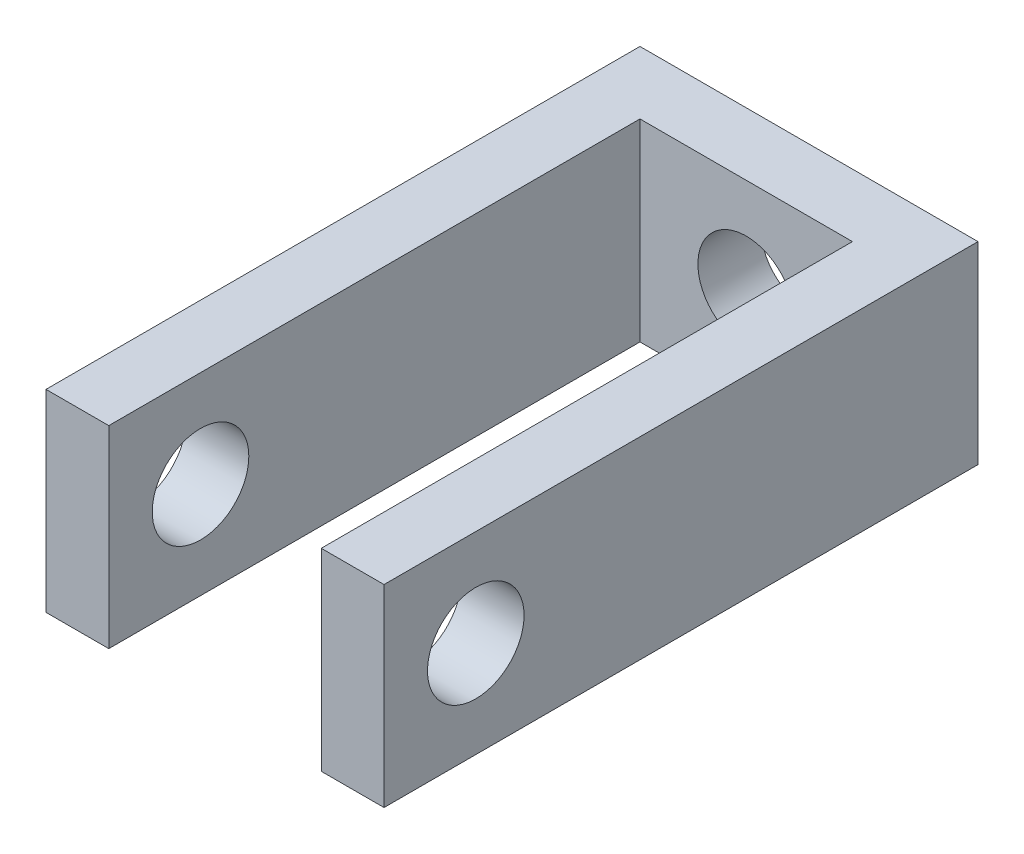
ISO-10303-21;
HEADER;
FILE_DESCRIPTION(('STEP AP214'),'2;1');
FILE_NAME('part.step','',(''),(''),'','','');
FILE_SCHEMA(('AUTOMOTIVE_DESIGN { 1 0 10303 214 1 1 1 1 }'));
ENDSEC;
DATA;
#1=APPLICATION_CONTEXT('core data for automotive mechanical design processes');
#2=APPLICATION_PROTOCOL_DEFINITION('international standard','automotive_design',2000,#1);
#3=PRODUCT_CONTEXT('',#1,'mechanical');
#4=PRODUCT('Part','Part','',(#3));
#5=PRODUCT_RELATED_PRODUCT_CATEGORY('part','',(#4));
#6=PRODUCT_DEFINITION_FORMATION('','',#4);
#7=PRODUCT_DEFINITION_CONTEXT('part definition',#1,'design');
#8=PRODUCT_DEFINITION('design','',#6,#7);
#9=PRODUCT_DEFINITION_SHAPE('','',#8);
#10=(LENGTH_UNIT() NAMED_UNIT(*) SI_UNIT(.MILLI.,.METRE.));
#11=(NAMED_UNIT(*) PLANE_ANGLE_UNIT() SI_UNIT($,.RADIAN.));
#12=(NAMED_UNIT(*) SI_UNIT($,.STERADIAN.) SOLID_ANGLE_UNIT());
#13=UNCERTAINTY_MEASURE_WITH_UNIT(LENGTH_MEASURE(1.E-05),#10,'distance_accuracy_value','');
#14=(GEOMETRIC_REPRESENTATION_CONTEXT(3) GLOBAL_UNCERTAINTY_ASSIGNED_CONTEXT((#13)) GLOBAL_UNIT_ASSIGNED_CONTEXT((#10,
#11,#12)) REPRESENTATION_CONTEXT('',''));
#15=CARTESIAN_POINT('',(0.,0.,0.));
#16=DIRECTION('',(0.,0.,1.));
#17=DIRECTION('',(1.,0.,0.));
#18=AXIS2_PLACEMENT_3D('',#15,#16,#17);
#19=CARTESIAN_POINT('',(0.,0.,1.3));
#20=DIRECTION('',(0.,0.,-1.));
#21=DIRECTION('',(-1.,0.,0.));
#22=AXIS2_PLACEMENT_3D('',#19,#20,#21);
#23=PLANE('',#22);
#24=CARTESIAN_POINT('',(3.5,2.,1.3));
#25=DIRECTION('',(0.,0.,1.));
#26=DIRECTION('',(1.,0.,0.));
#27=AXIS2_PLACEMENT_3D('',#24,#25,#26);
#28=CIRCLE('',#27,0.999999999999999);
#29=CARTESIAN_POINT('',(4.5,2.,1.3));
#30=VERTEX_POINT('',#29);
#31=EDGE_CURVE('E140',#30,#30,#28,.T.);
#32=ORIENTED_EDGE('',*,*,#31,.F.);
#33=EDGE_LOOP('',(#32));
#34=FACE_BOUND('',#33,.T.);
#35=DIRECTION('',(0.,-1.,0.));
#36=VECTOR('',#35,1.);
#37=CARTESIAN_POINT('',(5.7,4.,1.3));
#38=LINE('',#37,#36);
#39=CARTESIAN_POINT('',(5.7,4.,1.3));
#40=VERTEX_POINT('',#39);
#41=CARTESIAN_POINT('',(5.7,0.,1.3));
#42=VERTEX_POINT('',#41);
#43=EDGE_CURVE('E134',#40,#42,#38,.T.);
#44=ORIENTED_EDGE('',*,*,#43,.F.);
#45=DIRECTION('',(-1.,0.,0.));
#46=VECTOR('',#45,1.);
#47=CARTESIAN_POINT('',(0.,4.,1.3));
#48=LINE('',#47,#46);
#49=CARTESIAN_POINT('',(1.3,4.,1.3));
#50=VERTEX_POINT('',#49);
#51=EDGE_CURVE('E180',#40,#50,#48,.T.);
#52=ORIENTED_EDGE('',*,*,#51,.T.);
#53=DIRECTION('',(0.,1.,0.));
#54=VECTOR('',#53,1.);
#55=CARTESIAN_POINT('',(1.3,4.,1.3));
#56=LINE('',#55,#54);
#57=CARTESIAN_POINT('',(1.3,0.,1.3));
#58=VERTEX_POINT('',#57);
#59=EDGE_CURVE('E62',#58,#50,#56,.T.);
#60=ORIENTED_EDGE('',*,*,#59,.F.);
#61=DIRECTION('',(1.,0.,0.));
#62=VECTOR('',#61,1.);
#63=CARTESIAN_POINT('',(0.,0.,1.3));
#64=LINE('',#63,#62);
#65=EDGE_CURVE('E57',#58,#42,#64,.T.);
#66=ORIENTED_EDGE('',*,*,#65,.T.);
#67=EDGE_LOOP('',(#44,#52,#60,#66));
#68=FACE_BOUND('',#67,.T.);
#69=ADVANCED_FACE('F39',(#34,#68),#23,.F.);
#70=CARTESIAN_POINT('',(0.,0.,1.3));
#71=DIRECTION('',(1.,0.,0.));
#72=DIRECTION('',(0.,0.,-1.));
#73=AXIS2_PLACEMENT_3D('',#70,#71,#72);
#74=PLANE('',#73);
#75=CARTESIAN_POINT('',(0.,2.,10.4));
#76=DIRECTION('',(1.,0.,0.));
#77=DIRECTION('',(0.,0.,-1.));
#78=AXIS2_PLACEMENT_3D('',#75,#76,#77);
#79=CIRCLE('',#78,1.);
#80=CARTESIAN_POINT('',(0.,2.,9.4));
#81=VERTEX_POINT('',#80);
#82=EDGE_CURVE('E213',#81,#81,#79,.T.);
#83=ORIENTED_EDGE('',*,*,#82,.T.);
#84=EDGE_LOOP('',(#83));
#85=FACE_BOUND('',#84,.T.);
#86=DIRECTION('',(0.,-1.,0.));
#87=VECTOR('',#86,1.);
#88=CARTESIAN_POINT('',(0.,0.,0.));
#89=LINE('',#88,#87);
#90=CARTESIAN_POINT('',(0.,4.,0.));
#91=VERTEX_POINT('',#90);
#92=CARTESIAN_POINT('',(0.,0.,0.));
#93=VERTEX_POINT('',#92);
#94=EDGE_CURVE('E177',#91,#93,#89,.T.);
#95=ORIENTED_EDGE('',*,*,#94,.T.);
#96=DIRECTION('',(0.,0.,-1.));
#97=VECTOR('',#96,1.);
#98=CARTESIAN_POINT('',(0.,0.,1.3));
#99=LINE('',#98,#97);
#100=CARTESIAN_POINT('',(0.,0.,12.3));
#101=VERTEX_POINT('',#100);
#102=EDGE_CURVE('E11',#101,#93,#99,.T.);
#103=ORIENTED_EDGE('',*,*,#102,.F.);
#104=DIRECTION('',(0.,-1.,0.));
#105=VECTOR('',#104,1.);
#106=CARTESIAN_POINT('',(0.,4.,12.3));
#107=LINE('',#106,#105);
#108=CARTESIAN_POINT('',(0.,4.,12.3));
#109=VERTEX_POINT('',#108);
#110=EDGE_CURVE('E153',#109,#101,#107,.T.);
#111=ORIENTED_EDGE('',*,*,#110,.F.);
#112=DIRECTION('',(0.,0.,-1.));
#113=VECTOR('',#112,1.);
#114=CARTESIAN_POINT('',(0.,4.,1.3));
#115=LINE('',#114,#113);
#116=EDGE_CURVE('E117',#109,#91,#115,.T.);
#117=ORIENTED_EDGE('',*,*,#116,.T.);
#118=EDGE_LOOP('',(#95,#103,#111,#117));
#119=FACE_BOUND('',#118,.T.);
#120=ADVANCED_FACE('F41',(#85,#119),#74,.F.);
#121=CARTESIAN_POINT('',(0.,0.,1.3));
#122=DIRECTION('',(0.,1.,0.));
#123=DIRECTION('',(0.,0.,1.));
#124=AXIS2_PLACEMENT_3D('',#121,#122,#123);
#125=PLANE('',#124);
#126=DIRECTION('',(1.,0.,0.));
#127=VECTOR('',#126,1.);
#128=CARTESIAN_POINT('',(0.,0.,0.));
#129=LINE('',#128,#127);
#130=CARTESIAN_POINT('',(7.,0.,0.));
#131=VERTEX_POINT('',#130);
#132=EDGE_CURVE('E187',#93,#131,#129,.T.);
#133=ORIENTED_EDGE('',*,*,#132,.T.);
#134=DIRECTION('',(0.,0.,-1.));
#135=VECTOR('',#134,1.);
#136=CARTESIAN_POINT('',(7.,0.,1.3));
#137=LINE('',#136,#135);
#138=CARTESIAN_POINT('',(7.,0.,12.3));
#139=VERTEX_POINT('',#138);
#140=EDGE_CURVE('E49',#139,#131,#137,.T.);
#141=ORIENTED_EDGE('',*,*,#140,.F.);
#142=DIRECTION('',(1.,0.,0.));
#143=VECTOR('',#142,1.);
#144=CARTESIAN_POINT('',(7.,0.,12.3));
#145=LINE('',#144,#143);
#146=CARTESIAN_POINT('',(5.7,0.,12.3));
#147=VERTEX_POINT('',#146);
#148=EDGE_CURVE('E132',#147,#139,#145,.T.);
#149=ORIENTED_EDGE('',*,*,#148,.F.);
#150=DIRECTION('',(0.,0.,-1.));
#151=VECTOR('',#150,1.);
#152=CARTESIAN_POINT('',(5.7,0.,12.3));
#153=LINE('',#152,#151);
#154=EDGE_CURVE('E146',#147,#42,#153,.T.);
#155=ORIENTED_EDGE('',*,*,#154,.T.);
#156=ORIENTED_EDGE('',*,*,#65,.F.);
#157=DIRECTION('',(0.,0.,-1.));
#158=VECTOR('',#157,1.);
#159=CARTESIAN_POINT('',(1.3,0.,12.3));
#160=LINE('',#159,#158);
#161=CARTESIAN_POINT('',(1.3,0.,12.3));
#162=VERTEX_POINT('',#161);
#163=EDGE_CURVE('E173',#162,#58,#160,.T.);
#164=ORIENTED_EDGE('',*,*,#163,.F.);
#165=DIRECTION('',(1.,0.,0.));
#166=VECTOR('',#165,1.);
#167=CARTESIAN_POINT('',(0.,0.,12.3));
#168=LINE('',#167,#166);
#169=EDGE_CURVE('E157',#101,#162,#168,.T.);
#170=ORIENTED_EDGE('',*,*,#169,.F.);
#171=ORIENTED_EDGE('',*,*,#102,.T.);
#172=EDGE_LOOP('',(#133,#141,#149,#155,#156,#164,#170,#171));
#173=FACE_BOUND('',#172,.T.);
#174=ADVANCED_FACE('F242',(#173),#125,.F.);
#175=CARTESIAN_POINT('',(7.,0.,1.3));
#176=DIRECTION('',(-1.,0.,0.));
#177=DIRECTION('',(0.,0.,1.));
#178=AXIS2_PLACEMENT_3D('',#175,#176,#177);
#179=PLANE('',#178);
#180=CARTESIAN_POINT('',(7.,2.,10.4));
#181=DIRECTION('',(1.,0.,0.));
#182=DIRECTION('',(0.,0.,-1.));
#183=AXIS2_PLACEMENT_3D('',#180,#181,#182);
#184=CIRCLE('',#183,1.);
#185=CARTESIAN_POINT('',(7.,2.,9.4));
#186=VERTEX_POINT('',#185);
#187=EDGE_CURVE('E215',#186,#186,#184,.T.);
#188=ORIENTED_EDGE('',*,*,#187,.F.);
#189=EDGE_LOOP('',(#188));
#190=FACE_BOUND('',#189,.T.);
#191=DIRECTION('',(0.,1.,0.));
#192=VECTOR('',#191,1.);
#193=CARTESIAN_POINT('',(7.,0.,0.));
#194=LINE('',#193,#192);
#195=CARTESIAN_POINT('',(7.,4.,0.));
#196=VERTEX_POINT('',#195);
#197=EDGE_CURVE('E113',#131,#196,#194,.T.);
#198=ORIENTED_EDGE('',*,*,#197,.T.);
#199=DIRECTION('',(0.,0.,-1.));
#200=VECTOR('',#199,1.);
#201=CARTESIAN_POINT('',(7.,4.,1.3));
#202=LINE('',#201,#200);
#203=CARTESIAN_POINT('',(7.,4.,12.3));
#204=VERTEX_POINT('',#203);
#205=EDGE_CURVE('E106',#204,#196,#202,.T.);
#206=ORIENTED_EDGE('',*,*,#205,.F.);
#207=DIRECTION('',(0.,1.,0.));
#208=VECTOR('',#207,1.);
#209=CARTESIAN_POINT('',(7.,4.,12.3));
#210=LINE('',#209,#208);
#211=EDGE_CURVE('E111',#139,#204,#210,.T.);
#212=ORIENTED_EDGE('',*,*,#211,.F.);
#213=ORIENTED_EDGE('',*,*,#140,.T.);
#214=EDGE_LOOP('',(#198,#206,#212,#213));
#215=FACE_BOUND('',#214,.T.);
#216=ADVANCED_FACE('F108',(#190,#215),#179,.F.);
#217=CARTESIAN_POINT('',(0.,4.,1.3));
#218=DIRECTION('',(0.,-1.,0.));
#219=DIRECTION('',(0.,0.,-1.));
#220=AXIS2_PLACEMENT_3D('',#217,#218,#219);
#221=PLANE('',#220);
#222=DIRECTION('',(-1.,0.,0.));
#223=VECTOR('',#222,1.);
#224=CARTESIAN_POINT('',(0.,4.,0.));
#225=LINE('',#224,#223);
#226=EDGE_CURVE('E181',#196,#91,#225,.T.);
#227=ORIENTED_EDGE('',*,*,#226,.T.);
#228=ORIENTED_EDGE('',*,*,#116,.F.);
#229=DIRECTION('',(-1.,0.,0.));
#230=VECTOR('',#229,1.);
#231=CARTESIAN_POINT('',(0.,4.,12.3));
#232=LINE('',#231,#230);
#233=CARTESIAN_POINT('',(1.3,4.,12.3));
#234=VERTEX_POINT('',#233);
#235=EDGE_CURVE('E163',#234,#109,#232,.T.);
#236=ORIENTED_EDGE('',*,*,#235,.F.);
#237=DIRECTION('',(0.,0.,-1.));
#238=VECTOR('',#237,1.);
#239=CARTESIAN_POINT('',(1.3,4.,12.3));
#240=LINE('',#239,#238);
#241=EDGE_CURVE('E167',#234,#50,#240,.T.);
#242=ORIENTED_EDGE('',*,*,#241,.T.);
#243=ORIENTED_EDGE('',*,*,#51,.F.);
#244=DIRECTION('',(0.,0.,-1.));
#245=VECTOR('',#244,1.);
#246=CARTESIAN_POINT('',(5.7,4.,12.3));
#247=LINE('',#246,#245);
#248=CARTESIAN_POINT('',(5.7,4.,12.3));
#249=VERTEX_POINT('',#248);
#250=EDGE_CURVE('E123',#249,#40,#247,.T.);
#251=ORIENTED_EDGE('',*,*,#250,.F.);
#252=DIRECTION('',(-1.,0.,0.));
#253=VECTOR('',#252,1.);
#254=CARTESIAN_POINT('',(7.,4.,12.3));
#255=LINE('',#254,#253);
#256=EDGE_CURVE('E120',#204,#249,#255,.T.);
#257=ORIENTED_EDGE('',*,*,#256,.F.);
#258=ORIENTED_EDGE('',*,*,#205,.T.);
#259=EDGE_LOOP('',(#227,#228,#236,#242,#243,#251,#257,#258));
#260=FACE_BOUND('',#259,.T.);
#261=ADVANCED_FACE('F121',(#260),#221,.F.);
#262=CARTESIAN_POINT('',(0.,0.,0.));
#263=DIRECTION('',(0.,0.,-1.));
#264=DIRECTION('',(-1.,0.,0.));
#265=AXIS2_PLACEMENT_3D('',#262,#263,#264);
#266=PLANE('',#265);
#267=CARTESIAN_POINT('',(3.5,2.,0.));
#268=DIRECTION('',(0.,0.,-1.));
#269=DIRECTION('',(-1.,0.,0.));
#270=AXIS2_PLACEMENT_3D('',#267,#268,#269);
#271=CIRCLE('',#270,0.999999999999999);
#272=CARTESIAN_POINT('',(2.5,2.,0.));
#273=VERTEX_POINT('',#272);
#274=EDGE_CURVE('E137',#273,#273,#271,.T.);
#275=ORIENTED_EDGE('',*,*,#274,.F.);
#276=EDGE_LOOP('',(#275));
#277=FACE_BOUND('',#276,.T.);
#278=ORIENTED_EDGE('',*,*,#94,.F.);
#279=ORIENTED_EDGE('',*,*,#226,.F.);
#280=ORIENTED_EDGE('',*,*,#197,.F.);
#281=ORIENTED_EDGE('',*,*,#132,.F.);
#282=EDGE_LOOP('',(#278,#279,#280,#281));
#283=FACE_BOUND('',#282,.T.);
#284=ADVANCED_FACE('F247',(#277,#283),#266,.T.);
#285=CARTESIAN_POINT('',(1.3,4.,12.3));
#286=DIRECTION('',(-1.,0.,0.));
#287=DIRECTION('',(0.,-1.,0.));
#288=AXIS2_PLACEMENT_3D('',#285,#286,#287);
#289=PLANE('',#288);
#290=CARTESIAN_POINT('',(1.3,2.,10.4));
#291=DIRECTION('',(-1.,0.,0.));
#292=DIRECTION('',(0.,-1.,0.));
#293=AXIS2_PLACEMENT_3D('',#290,#291,#292);
#294=CIRCLE('',#293,1.);
#295=CARTESIAN_POINT('',(1.3,1.,10.4));
#296=VERTEX_POINT('',#295);
#297=EDGE_CURVE('E204',#296,#296,#294,.T.);
#298=ORIENTED_EDGE('',*,*,#297,.T.);
#299=EDGE_LOOP('',(#298));
#300=FACE_BOUND('',#299,.T.);
#301=ORIENTED_EDGE('',*,*,#59,.T.);
#302=ORIENTED_EDGE('',*,*,#241,.F.);
#303=DIRECTION('',(0.,1.,0.));
#304=VECTOR('',#303,1.);
#305=CARTESIAN_POINT('',(1.3,4.,12.3));
#306=LINE('',#305,#304);
#307=EDGE_CURVE('E160',#162,#234,#306,.T.);
#308=ORIENTED_EDGE('',*,*,#307,.F.);
#309=ORIENTED_EDGE('',*,*,#163,.T.);
#310=EDGE_LOOP('',(#301,#302,#308,#309));
#311=FACE_BOUND('',#310,.T.);
#312=ADVANCED_FACE('F245',(#300,#311),#289,.F.);
#313=CARTESIAN_POINT('',(0.,0.,12.3));
#314=DIRECTION('',(0.,0.,1.));
#315=DIRECTION('',(1.,0.,0.));
#316=AXIS2_PLACEMENT_3D('',#313,#314,#315);
#317=PLANE('',#316);
#318=ORIENTED_EDGE('',*,*,#110,.T.);
#319=ORIENTED_EDGE('',*,*,#169,.T.);
#320=ORIENTED_EDGE('',*,*,#307,.T.);
#321=ORIENTED_EDGE('',*,*,#235,.T.);
#322=EDGE_LOOP('',(#318,#319,#320,#321));
#323=FACE_BOUND('',#322,.T.);
#324=ADVANCED_FACE('F265',(#323),#317,.T.);
#325=CARTESIAN_POINT('',(5.7,4.,12.3));
#326=DIRECTION('',(1.,0.,0.));
#327=DIRECTION('',(0.,1.,0.));
#328=AXIS2_PLACEMENT_3D('',#325,#326,#327);
#329=PLANE('',#328);
#330=CARTESIAN_POINT('',(5.7,2.,10.4));
#331=DIRECTION('',(1.,0.,0.));
#332=DIRECTION('',(0.,1.,0.));
#333=AXIS2_PLACEMENT_3D('',#330,#331,#332);
#334=CIRCLE('',#333,1.);
#335=CARTESIAN_POINT('',(5.7,3.,10.4));
#336=VERTEX_POINT('',#335);
#337=EDGE_CURVE('E43',#336,#336,#334,.T.);
#338=ORIENTED_EDGE('',*,*,#337,.T.);
#339=EDGE_LOOP('',(#338));
#340=FACE_BOUND('',#339,.T.);
#341=ORIENTED_EDGE('',*,*,#43,.T.);
#342=ORIENTED_EDGE('',*,*,#154,.F.);
#343=DIRECTION('',(0.,-1.,0.));
#344=VECTOR('',#343,1.);
#345=CARTESIAN_POINT('',(5.7,4.,12.3));
#346=LINE('',#345,#344);
#347=EDGE_CURVE('E127',#249,#147,#346,.T.);
#348=ORIENTED_EDGE('',*,*,#347,.F.);
#349=ORIENTED_EDGE('',*,*,#250,.T.);
#350=EDGE_LOOP('',(#341,#342,#348,#349));
#351=FACE_BOUND('',#350,.T.);
#352=ADVANCED_FACE('F272',(#340,#351),#329,.F.);
#353=CARTESIAN_POINT('',(0.,0.,12.3));
#354=DIRECTION('',(0.,0.,-1.));
#355=DIRECTION('',(-1.,0.,0.));
#356=AXIS2_PLACEMENT_3D('',#353,#354,#355);
#357=PLANE('',#356);
#358=ORIENTED_EDGE('',*,*,#211,.T.);
#359=ORIENTED_EDGE('',*,*,#256,.T.);
#360=ORIENTED_EDGE('',*,*,#347,.T.);
#361=ORIENTED_EDGE('',*,*,#148,.T.);
#362=EDGE_LOOP('',(#358,#359,#360,#361));
#363=FACE_BOUND('',#362,.T.);
#364=ADVANCED_FACE('F130',(#363),#357,.F.);
#365=CARTESIAN_POINT('',(3.5,2.,-0.7));
#366=DIRECTION('',(0.,0.,1.));
#367=DIRECTION('',(1.,0.,0.));
#368=AXIS2_PLACEMENT_3D('',#365,#366,#367);
#369=CYLINDRICAL_SURFACE('',#368,0.999999999999999);
#370=ORIENTED_EDGE('',*,*,#274,.T.);
#371=EDGE_LOOP('',(#370));
#372=FACE_BOUND('',#371,.T.);
#373=ORIENTED_EDGE('',*,*,#31,.T.);
#374=EDGE_LOOP('',(#373));
#375=FACE_BOUND('',#374,.T.);
#376=ADVANCED_FACE('F233',(#372,#375),#369,.F.);
#377=CARTESIAN_POINT('',(0.,2.,10.4));
#378=DIRECTION('',(1.,0.,0.));
#379=DIRECTION('',(0.,0.,-1.));
#380=AXIS2_PLACEMENT_3D('',#377,#378,#379);
#381=CYLINDRICAL_SURFACE('',#380,1.);
#382=ORIENTED_EDGE('',*,*,#187,.T.);
#383=EDGE_LOOP('',(#382));
#384=FACE_BOUND('',#383,.T.);
#385=ORIENTED_EDGE('',*,*,#337,.F.);
#386=EDGE_LOOP('',(#385));
#387=FACE_BOUND('',#386,.T.);
#388=ADVANCED_FACE('F228',(#384,#387),#381,.F.);
#389=ORIENTED_EDGE('',*,*,#82,.F.);
#390=EDGE_LOOP('',(#389));
#391=FACE_BOUND('',#390,.T.);
#392=ORIENTED_EDGE('',*,*,#297,.F.);
#393=EDGE_LOOP('',(#392));
#394=FACE_BOUND('',#393,.T.);
#395=ADVANCED_FACE('F225',(#391,#394),#381,.F.);
#396=CLOSED_SHELL('',(#69,#120,#174,#216,#261,#284,#312,#324,#352,#364,#376,#388,#395));
#397=MANIFOLD_SOLID_BREP('B2',#396);
#398=ADVANCED_BREP_SHAPE_REPRESENTATION('',(#18,#397),#14);
#399=SHAPE_DEFINITION_REPRESENTATION(#9,#398);
ENDSEC;
END-ISO-10303-21;
